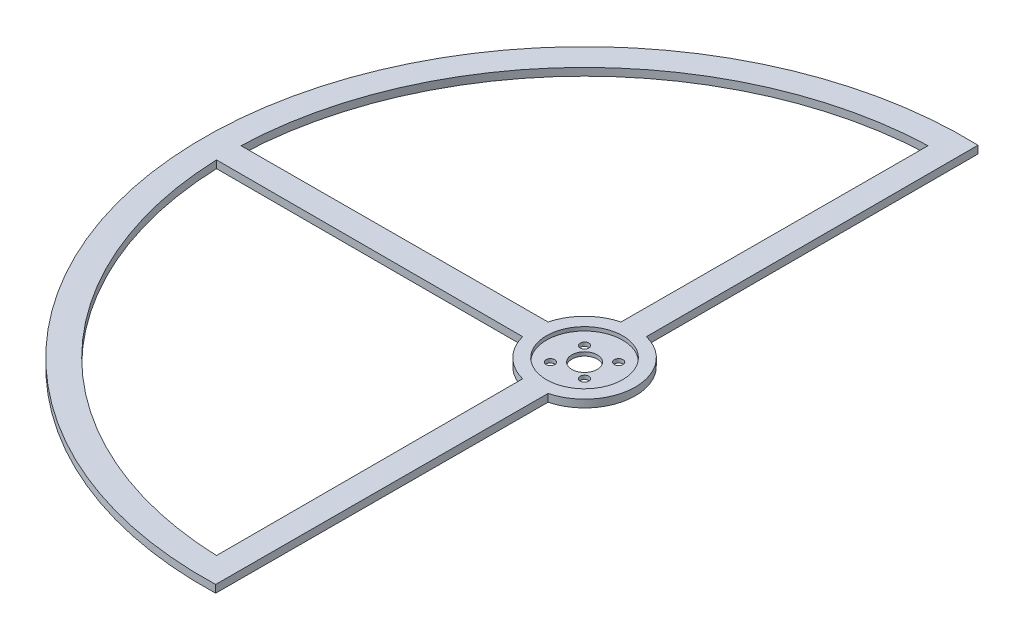
ISO-10303-21;
HEADER;
FILE_DESCRIPTION(('STEP AP214'),'2;1');
FILE_NAME('part.step','',(''),(''),'','','');
FILE_SCHEMA(('AUTOMOTIVE_DESIGN { 1 0 10303 214 1 1 1 1 }'));
ENDSEC;
DATA;
#1=APPLICATION_CONTEXT('core data for automotive mechanical design processes');
#2=APPLICATION_PROTOCOL_DEFINITION('international standard','automotive_design',2000,#1);
#3=PRODUCT_CONTEXT('',#1,'mechanical');
#4=PRODUCT('Part','Part','',(#3));
#5=PRODUCT_RELATED_PRODUCT_CATEGORY('part','',(#4));
#6=PRODUCT_DEFINITION_FORMATION('','',#4);
#7=PRODUCT_DEFINITION_CONTEXT('part definition',#1,'design');
#8=PRODUCT_DEFINITION('design','',#6,#7);
#9=PRODUCT_DEFINITION_SHAPE('','',#8);
#10=(LENGTH_UNIT() NAMED_UNIT(*) SI_UNIT(.MILLI.,.METRE.));
#11=(NAMED_UNIT(*) PLANE_ANGLE_UNIT() SI_UNIT($,.RADIAN.));
#12=(NAMED_UNIT(*) SI_UNIT($,.STERADIAN.) SOLID_ANGLE_UNIT());
#13=UNCERTAINTY_MEASURE_WITH_UNIT(LENGTH_MEASURE(1.E-05),#10,'distance_accuracy_value','');
#14=(GEOMETRIC_REPRESENTATION_CONTEXT(3) GLOBAL_UNCERTAINTY_ASSIGNED_CONTEXT((#13)) GLOBAL_UNIT_ASSIGNED_CONTEXT((#10,
#11,#12)) REPRESENTATION_CONTEXT('',''));
#15=CARTESIAN_POINT('',(0.,0.,0.));
#16=DIRECTION('',(0.,0.,1.));
#17=DIRECTION('',(1.,0.,0.));
#18=AXIS2_PLACEMENT_3D('',#15,#16,#17);
#19=CARTESIAN_POINT('',(0.,3.,0.));
#20=DIRECTION('',(0.,-1.,0.));
#21=DIRECTION('',(0.,0.,-1.));
#22=AXIS2_PLACEMENT_3D('',#19,#20,#21);
#23=CYLINDRICAL_SURFACE('',#22,5.);
#24=CARTESIAN_POINT('',(0.,0.,0.));
#25=DIRECTION('',(0.,1.,0.));
#26=DIRECTION('',(0.,0.,1.));
#27=AXIS2_PLACEMENT_3D('',#24,#25,#26);
#28=CIRCLE('',#27,5.);
#29=CARTESIAN_POINT('',(0.,0.,5.));
#30=VERTEX_POINT('',#29);
#31=EDGE_CURVE('E203',#30,#30,#28,.T.);
#32=ORIENTED_EDGE('',*,*,#31,.F.);
#33=EDGE_LOOP('',(#32));
#34=FACE_BOUND('',#33,.T.);
#35=CARTESIAN_POINT('',(0.,1.5,0.));
#36=DIRECTION('',(0.,1.,0.));
#37=DIRECTION('',(0.,0.,1.));
#38=AXIS2_PLACEMENT_3D('',#35,#36,#37);
#39=CIRCLE('',#38,5.);
#40=CARTESIAN_POINT('',(0.,1.5,5.));
#41=VERTEX_POINT('',#40);
#42=EDGE_CURVE('E151',#41,#41,#39,.T.);
#43=ORIENTED_EDGE('',*,*,#42,.T.);
#44=EDGE_LOOP('',(#43));
#45=FACE_BOUND('',#44,.T.);
#46=ADVANCED_FACE('F32',(#34,#45),#23,.F.);
#47=CARTESIAN_POINT('',(-5.65685424949238,3.,-5.65685424949238));
#48=DIRECTION('',(0.,-1.,0.));
#49=DIRECTION('',(0.,0.,-1.));
#50=AXIS2_PLACEMENT_3D('',#47,#48,#49);
#51=CYLINDRICAL_SURFACE('',#50,1.7);
#52=CARTESIAN_POINT('',(-5.65685424949238,0.,-5.65685424949238));
#53=DIRECTION('',(0.,1.,0.));
#54=DIRECTION('',(0.,0.,1.));
#55=AXIS2_PLACEMENT_3D('',#52,#53,#54);
#56=CIRCLE('',#55,1.7);
#57=CARTESIAN_POINT('',(-5.65685424949238,0.,-3.95685424949238));
#58=VERTEX_POINT('',#57);
#59=EDGE_CURVE('E200',#58,#58,#56,.T.);
#60=ORIENTED_EDGE('',*,*,#59,.F.);
#61=EDGE_LOOP('',(#60));
#62=FACE_BOUND('',#61,.T.);
#63=CARTESIAN_POINT('',(-5.65685424949238,1.5,-5.65685424949238));
#64=DIRECTION('',(0.,1.,0.));
#65=DIRECTION('',(0.,0.,1.));
#66=AXIS2_PLACEMENT_3D('',#63,#64,#65);
#67=CIRCLE('',#66,1.7);
#68=CARTESIAN_POINT('',(-5.65685424949238,1.5,-3.95685424949238));
#69=VERTEX_POINT('',#68);
#70=EDGE_CURVE('E311',#69,#69,#67,.T.);
#71=ORIENTED_EDGE('',*,*,#70,.T.);
#72=EDGE_LOOP('',(#71));
#73=FACE_BOUND('',#72,.T.);
#74=ADVANCED_FACE('F259',(#62,#73),#51,.F.);
#75=CARTESIAN_POINT('',(5.65685424949238,3.,5.65685424949238));
#76=DIRECTION('',(0.,-1.,0.));
#77=DIRECTION('',(0.,0.,-1.));
#78=AXIS2_PLACEMENT_3D('',#75,#76,#77);
#79=CYLINDRICAL_SURFACE('',#78,1.7);
#80=CARTESIAN_POINT('',(5.65685424949238,0.,5.65685424949238));
#81=DIRECTION('',(0.,1.,0.));
#82=DIRECTION('',(0.,0.,1.));
#83=AXIS2_PLACEMENT_3D('',#80,#81,#82);
#84=CIRCLE('',#83,1.7);
#85=CARTESIAN_POINT('',(5.65685424949238,0.,7.35685424949238));
#86=VERTEX_POINT('',#85);
#87=EDGE_CURVE('E197',#86,#86,#84,.T.);
#88=ORIENTED_EDGE('',*,*,#87,.F.);
#89=EDGE_LOOP('',(#88));
#90=FACE_BOUND('',#89,.T.);
#91=CARTESIAN_POINT('',(5.65685424949238,1.5,5.65685424949238));
#92=DIRECTION('',(0.,1.,0.));
#93=DIRECTION('',(0.,0.,1.));
#94=AXIS2_PLACEMENT_3D('',#91,#92,#93);
#95=CIRCLE('',#94,1.7);
#96=CARTESIAN_POINT('',(5.65685424949238,1.5,7.35685424949238));
#97=VERTEX_POINT('',#96);
#98=EDGE_CURVE('E309',#97,#97,#95,.T.);
#99=ORIENTED_EDGE('',*,*,#98,.T.);
#100=EDGE_LOOP('',(#99));
#101=FACE_BOUND('',#100,.T.);
#102=ADVANCED_FACE('F265',(#90,#101),#79,.F.);
#103=CARTESIAN_POINT('',(6.7175144212722,3.,-6.7175144212722));
#104=DIRECTION('',(0.,-1.,0.));
#105=DIRECTION('',(0.,0.,-1.));
#106=AXIS2_PLACEMENT_3D('',#103,#104,#105);
#107=CYLINDRICAL_SURFACE('',#106,1.7);
#108=CARTESIAN_POINT('',(6.7175144212722,0.,-6.7175144212722));
#109=DIRECTION('',(0.,1.,0.));
#110=DIRECTION('',(0.,0.,1.));
#111=AXIS2_PLACEMENT_3D('',#108,#109,#110);
#112=CIRCLE('',#111,1.7);
#113=CARTESIAN_POINT('',(6.7175144212722,0.,-5.0175144212722));
#114=VERTEX_POINT('',#113);
#115=EDGE_CURVE('E194',#114,#114,#112,.T.);
#116=ORIENTED_EDGE('',*,*,#115,.F.);
#117=EDGE_LOOP('',(#116));
#118=FACE_BOUND('',#117,.T.);
#119=CARTESIAN_POINT('',(6.7175144212722,1.5,-6.7175144212722));
#120=DIRECTION('',(0.,1.,0.));
#121=DIRECTION('',(0.,0.,1.));
#122=AXIS2_PLACEMENT_3D('',#119,#120,#121);
#123=CIRCLE('',#122,1.7);
#124=CARTESIAN_POINT('',(6.7175144212722,1.5,-5.0175144212722));
#125=VERTEX_POINT('',#124);
#126=EDGE_CURVE('E312',#125,#125,#123,.T.);
#127=ORIENTED_EDGE('',*,*,#126,.T.);
#128=EDGE_LOOP('',(#127));
#129=FACE_BOUND('',#128,.T.);
#130=ADVANCED_FACE('F297',(#118,#129),#107,.F.);
#131=CARTESIAN_POINT('',(-6.7175144212722,3.,6.7175144212722));
#132=DIRECTION('',(0.,-1.,0.));
#133=DIRECTION('',(0.,0.,-1.));
#134=AXIS2_PLACEMENT_3D('',#131,#132,#133);
#135=CYLINDRICAL_SURFACE('',#134,1.7);
#136=CARTESIAN_POINT('',(-6.7175144212722,0.,6.7175144212722));
#137=DIRECTION('',(0.,1.,0.));
#138=DIRECTION('',(0.,0.,1.));
#139=AXIS2_PLACEMENT_3D('',#136,#137,#138);
#140=CIRCLE('',#139,1.7);
#141=CARTESIAN_POINT('',(-6.7175144212722,0.,8.4175144212722));
#142=VERTEX_POINT('',#141);
#143=EDGE_CURVE('E191',#142,#142,#140,.T.);
#144=ORIENTED_EDGE('',*,*,#143,.F.);
#145=EDGE_LOOP('',(#144));
#146=FACE_BOUND('',#145,.T.);
#147=CARTESIAN_POINT('',(-6.7175144212722,1.5,6.7175144212722));
#148=DIRECTION('',(0.,1.,0.));
#149=DIRECTION('',(0.,0.,1.));
#150=AXIS2_PLACEMENT_3D('',#147,#148,#149);
#151=CIRCLE('',#150,1.7);
#152=CARTESIAN_POINT('',(-6.7175144212722,1.5,8.4175144212722));
#153=VERTEX_POINT('',#152);
#154=EDGE_CURVE('E36',#153,#153,#151,.T.);
#155=ORIENTED_EDGE('',*,*,#154,.T.);
#156=EDGE_LOOP('',(#155));
#157=FACE_BOUND('',#156,.T.);
#158=ADVANCED_FACE('F274',(#146,#157),#135,.F.);
#159=CARTESIAN_POINT('',(0.,3.,0.));
#160=DIRECTION('',(0.,1.,0.));
#161=DIRECTION('',(0.,0.,1.));
#162=AXIS2_PLACEMENT_3D('',#159,#160,#161);
#163=PLANE('',#162);
#164=CARTESIAN_POINT('',(0.,3.,0.));
#165=DIRECTION('',(0.,1.,0.));
#166=DIRECTION('',(0.,0.,1.));
#167=AXIS2_PLACEMENT_3D('',#164,#165,#166);
#168=CIRCLE('',#167,15.);
#169=CARTESIAN_POINT('',(0.,3.,15.));
#170=VERTEX_POINT('',#169);
#171=EDGE_CURVE('E338',#170,#170,#168,.T.);
#172=ORIENTED_EDGE('',*,*,#171,.F.);
#173=EDGE_LOOP('',(#172));
#174=FACE_BOUND('',#173,.T.);
#175=DIRECTION('',(0.,0.,-1.));
#176=VECTOR('',#175,1.);
#177=CARTESIAN_POINT('',(-5.,3.,19.3649167310371));
#178=LINE('',#177,#176);
#179=CARTESIAN_POINT('',(-4.99999999999998,3.,139.910685796332));
#180=VERTEX_POINT('',#179);
#181=CARTESIAN_POINT('',(-5.,3.,19.3649167310371));
#182=VERTEX_POINT('',#181);
#183=EDGE_CURVE('E163',#180,#182,#178,.T.);
#184=ORIENTED_EDGE('',*,*,#183,.F.);
#185=CARTESIAN_POINT('',(0.,3.,0.));
#186=DIRECTION('',(0.,1.,0.));
#187=DIRECTION('',(0.,0.,1.));
#188=AXIS2_PLACEMENT_3D('',#185,#186,#187);
#189=CIRCLE('',#188,140.);
#190=CARTESIAN_POINT('',(-139.910685796332,3.,5.00000000000002));
#191=VERTEX_POINT('',#190);
#192=EDGE_CURVE('E161',#191,#180,#189,.T.);
#193=ORIENTED_EDGE('',*,*,#192,.F.);
#194=DIRECTION('',(-1.,0.,0.));
#195=VECTOR('',#194,1.);
#196=CARTESIAN_POINT('',(-19.3649167310371,3.,5.));
#197=LINE('',#196,#195);
#198=CARTESIAN_POINT('',(-19.3649167310371,3.,5.));
#199=VERTEX_POINT('',#198);
#200=EDGE_CURVE('E169',#199,#191,#197,.T.);
#201=ORIENTED_EDGE('',*,*,#200,.F.);
#202=CARTESIAN_POINT('',(0.,3.,0.));
#203=DIRECTION('',(0.,-1.,0.));
#204=DIRECTION('',(0.,0.,1.));
#205=AXIS2_PLACEMENT_3D('',#202,#203,#204);
#206=CIRCLE('',#205,20.);
#207=EDGE_CURVE('E166',#182,#199,#206,.T.);
#208=ORIENTED_EDGE('',*,*,#207,.F.);
#209=EDGE_LOOP('',(#184,#193,#201,#208));
#210=FACE_BOUND('',#209,.T.);
#211=CARTESIAN_POINT('',(0.,3.,0.));
#212=DIRECTION('',(0.,1.,0.));
#213=DIRECTION('',(0.,0.,1.));
#214=AXIS2_PLACEMENT_3D('',#211,#212,#213);
#215=CIRCLE('',#214,150.);
#216=CARTESIAN_POINT('',(5.,3.,-149.916643505649));
#217=VERTEX_POINT('',#216);
#218=CARTESIAN_POINT('',(4.68749999999998,3.,149.92673992237));
#219=VERTEX_POINT('',#218);
#220=EDGE_CURVE('E207',#217,#219,#215,.T.);
#221=ORIENTED_EDGE('',*,*,#220,.T.);
#222=DIRECTION('',(0.00239349525942759,0.,-0.999997135586119));
#223=VECTOR('',#222,1.);
#224=CARTESIAN_POINT('',(5.,3.,19.3649167310371));
#225=LINE('',#224,#223);
#226=CARTESIAN_POINT('',(5.,3.,19.3649167310371));
#227=VERTEX_POINT('',#226);
#228=EDGE_CURVE('E210',#219,#227,#225,.T.);
#229=ORIENTED_EDGE('',*,*,#228,.T.);
#230=CARTESIAN_POINT('',(0.,3.,0.));
#231=DIRECTION('',(0.,1.,0.));
#232=DIRECTION('',(0.,0.,1.));
#233=AXIS2_PLACEMENT_3D('',#230,#231,#232);
#234=CIRCLE('',#233,20.);
#235=CARTESIAN_POINT('',(5.,3.,-19.3649167310371));
#236=VERTEX_POINT('',#235);
#237=EDGE_CURVE('E213',#227,#236,#234,.T.);
#238=ORIENTED_EDGE('',*,*,#237,.T.);
#239=DIRECTION('',(0.,0.,-1.));
#240=VECTOR('',#239,1.);
#241=CARTESIAN_POINT('',(5.,3.,-19.3649167310371));
#242=LINE('',#241,#240);
#243=EDGE_CURVE('E215',#236,#217,#242,.T.);
#244=ORIENTED_EDGE('',*,*,#243,.T.);
#245=EDGE_LOOP('',(#221,#229,#238,#244));
#246=FACE_BOUND('',#245,.T.);
#247=DIRECTION('',(0.999996177582726,0.,-0.00276492675085444));
#248=VECTOR('',#247,1.);
#249=CARTESIAN_POINT('',(-19.3649167310371,3.,-5.));
#250=LINE('',#249,#248);
#251=CARTESIAN_POINT('',(-139.922200605273,3.,-4.66666666666668));
#252=VERTEX_POINT('',#251);
#253=CARTESIAN_POINT('',(-19.3649167310371,3.,-5.));
#254=VERTEX_POINT('',#253);
#255=EDGE_CURVE('E130',#252,#254,#250,.T.);
#256=ORIENTED_EDGE('',*,*,#255,.F.);
#257=CARTESIAN_POINT('',(0.,3.,0.));
#258=DIRECTION('',(0.,1.,0.));
#259=DIRECTION('',(0.,0.,1.));
#260=AXIS2_PLACEMENT_3D('',#257,#258,#259);
#261=CIRCLE('',#260,140.);
#262=CARTESIAN_POINT('',(-4.66666666666665,3.,-139.922200605273));
#263=VERTEX_POINT('',#262);
#264=EDGE_CURVE('E122',#263,#252,#261,.T.);
#265=ORIENTED_EDGE('',*,*,#264,.F.);
#266=DIRECTION('',(0.00276492675085467,0.,-0.999996177582726));
#267=VECTOR('',#266,1.);
#268=CARTESIAN_POINT('',(-5.,3.,-19.3649167310371));
#269=LINE('',#268,#267);
#270=CARTESIAN_POINT('',(-5.,3.,-19.3649167310371));
#271=VERTEX_POINT('',#270);
#272=EDGE_CURVE('E145',#271,#263,#269,.T.);
#273=ORIENTED_EDGE('',*,*,#272,.F.);
#274=CARTESIAN_POINT('',(0.,3.,0.));
#275=DIRECTION('',(0.,-1.,0.));
#276=DIRECTION('',(0.,0.,1.));
#277=AXIS2_PLACEMENT_3D('',#274,#275,#276);
#278=CIRCLE('',#277,20.);
#279=EDGE_CURVE('E143',#254,#271,#278,.T.);
#280=ORIENTED_EDGE('',*,*,#279,.F.);
#281=EDGE_LOOP('',(#256,#265,#273,#280));
#282=FACE_BOUND('',#281,.T.);
#283=ADVANCED_FACE('F142',(#174,#210,#246,#282),#163,.T.);
#284=CARTESIAN_POINT('',(0.,0.,0.));
#285=DIRECTION('',(0.,1.,0.));
#286=DIRECTION('',(0.,0.,1.));
#287=AXIS2_PLACEMENT_3D('',#284,#285,#286);
#288=PLANE('',#287);
#289=CARTESIAN_POINT('',(0.,0.,0.));
#290=DIRECTION('',(0.,1.,0.));
#291=DIRECTION('',(0.,0.,1.));
#292=AXIS2_PLACEMENT_3D('',#289,#290,#291);
#293=CIRCLE('',#292,140.);
#294=CARTESIAN_POINT('',(-139.910685796332,0.,5.00000000000002));
#295=VERTEX_POINT('',#294);
#296=CARTESIAN_POINT('',(-4.99999999999998,0.,139.910685796332));
#297=VERTEX_POINT('',#296);
#298=EDGE_CURVE('E138',#295,#297,#293,.T.);
#299=ORIENTED_EDGE('',*,*,#298,.T.);
#300=DIRECTION('',(0.,0.,-1.));
#301=VECTOR('',#300,1.);
#302=CARTESIAN_POINT('',(-5.,0.,19.3649167310371));
#303=LINE('',#302,#301);
#304=CARTESIAN_POINT('',(-5.,0.,19.3649167310371));
#305=VERTEX_POINT('',#304);
#306=EDGE_CURVE('E174',#297,#305,#303,.T.);
#307=ORIENTED_EDGE('',*,*,#306,.T.);
#308=CARTESIAN_POINT('',(0.,0.,0.));
#309=DIRECTION('',(0.,-1.,0.));
#310=DIRECTION('',(0.,0.,1.));
#311=AXIS2_PLACEMENT_3D('',#308,#309,#310);
#312=CIRCLE('',#311,20.);
#313=CARTESIAN_POINT('',(-19.3649167310371,0.,5.));
#314=VERTEX_POINT('',#313);
#315=EDGE_CURVE('E177',#305,#314,#312,.T.);
#316=ORIENTED_EDGE('',*,*,#315,.T.);
#317=DIRECTION('',(-1.,0.,0.));
#318=VECTOR('',#317,1.);
#319=CARTESIAN_POINT('',(-19.3649167310371,0.,5.));
#320=LINE('',#319,#318);
#321=EDGE_CURVE('E164',#314,#295,#320,.T.);
#322=ORIENTED_EDGE('',*,*,#321,.T.);
#323=EDGE_LOOP('',(#299,#307,#316,#322));
#324=FACE_BOUND('',#323,.T.);
#325=ORIENTED_EDGE('',*,*,#115,.T.);
#326=EDGE_LOOP('',(#325));
#327=FACE_BOUND('',#326,.T.);
#328=ORIENTED_EDGE('',*,*,#59,.T.);
#329=EDGE_LOOP('',(#328));
#330=FACE_BOUND('',#329,.T.);
#331=CARTESIAN_POINT('',(0.,0.,0.));
#332=DIRECTION('',(0.,1.,0.));
#333=DIRECTION('',(0.,0.,1.));
#334=AXIS2_PLACEMENT_3D('',#331,#332,#333);
#335=CIRCLE('',#334,150.);
#336=CARTESIAN_POINT('',(5.,0.,-149.916643505649));
#337=VERTEX_POINT('',#336);
#338=CARTESIAN_POINT('',(4.68749999999998,0.,149.92673992237));
#339=VERTEX_POINT('',#338);
#340=EDGE_CURVE('E206',#337,#339,#335,.T.);
#341=ORIENTED_EDGE('',*,*,#340,.F.);
#342=DIRECTION('',(0.,0.,-1.));
#343=VECTOR('',#342,1.);
#344=CARTESIAN_POINT('',(5.,0.,-19.3649167310371));
#345=LINE('',#344,#343);
#346=CARTESIAN_POINT('',(5.,0.,-19.3649167310371));
#347=VERTEX_POINT('',#346);
#348=EDGE_CURVE('E211',#347,#337,#345,.T.);
#349=ORIENTED_EDGE('',*,*,#348,.F.);
#350=CARTESIAN_POINT('',(0.,0.,0.));
#351=DIRECTION('',(0.,1.,0.));
#352=DIRECTION('',(0.,0.,1.));
#353=AXIS2_PLACEMENT_3D('',#350,#351,#352);
#354=CIRCLE('',#353,20.);
#355=CARTESIAN_POINT('',(5.,0.,19.3649167310371));
#356=VERTEX_POINT('',#355);
#357=EDGE_CURVE('E222',#356,#347,#354,.T.);
#358=ORIENTED_EDGE('',*,*,#357,.F.);
#359=DIRECTION('',(0.00239349525942759,0.,-0.999997135586119));
#360=VECTOR('',#359,1.);
#361=CARTESIAN_POINT('',(5.,0.,19.3649167310371));
#362=LINE('',#361,#360);
#363=EDGE_CURVE('E220',#339,#356,#362,.T.);
#364=ORIENTED_EDGE('',*,*,#363,.F.);
#365=EDGE_LOOP('',(#341,#349,#358,#364));
#366=FACE_BOUND('',#365,.T.);
#367=ORIENTED_EDGE('',*,*,#31,.T.);
#368=EDGE_LOOP('',(#367));
#369=FACE_BOUND('',#368,.T.);
#370=ORIENTED_EDGE('',*,*,#87,.T.);
#371=EDGE_LOOP('',(#370));
#372=FACE_BOUND('',#371,.T.);
#373=ORIENTED_EDGE('',*,*,#143,.T.);
#374=EDGE_LOOP('',(#373));
#375=FACE_BOUND('',#374,.T.);
#376=CARTESIAN_POINT('',(0.,0.,0.));
#377=DIRECTION('',(0.,1.,0.));
#378=DIRECTION('',(0.,0.,1.));
#379=AXIS2_PLACEMENT_3D('',#376,#377,#378);
#380=CIRCLE('',#379,140.);
#381=CARTESIAN_POINT('',(-4.66666666666665,0.,-139.922200605273));
#382=VERTEX_POINT('',#381);
#383=CARTESIAN_POINT('',(-139.922200605273,0.,-4.66666666666668));
#384=VERTEX_POINT('',#383);
#385=EDGE_CURVE('E56',#382,#384,#380,.T.);
#386=ORIENTED_EDGE('',*,*,#385,.T.);
#387=DIRECTION('',(0.999996177582726,0.,-0.00276492675085444));
#388=VECTOR('',#387,1.);
#389=CARTESIAN_POINT('',(-19.3649167310371,0.,-5.));
#390=LINE('',#389,#388);
#391=CARTESIAN_POINT('',(-19.3649167310371,0.,-5.));
#392=VERTEX_POINT('',#391);
#393=EDGE_CURVE('E137',#384,#392,#390,.T.);
#394=ORIENTED_EDGE('',*,*,#393,.T.);
#395=CARTESIAN_POINT('',(0.,0.,0.));
#396=DIRECTION('',(0.,-1.,0.));
#397=DIRECTION('',(0.,0.,1.));
#398=AXIS2_PLACEMENT_3D('',#395,#396,#397);
#399=CIRCLE('',#398,20.);
#400=CARTESIAN_POINT('',(-4.99999999999999,0.,-19.3649167310371));
#401=VERTEX_POINT('',#400);
#402=EDGE_CURVE('E153',#392,#401,#399,.T.);
#403=ORIENTED_EDGE('',*,*,#402,.T.);
#404=DIRECTION('',(0.00276492675085467,0.,-0.999996177582726));
#405=VECTOR('',#404,1.);
#406=CARTESIAN_POINT('',(-5.,0.,-19.3649167310371));
#407=LINE('',#406,#405);
#408=EDGE_CURVE('E131',#401,#382,#407,.T.);
#409=ORIENTED_EDGE('',*,*,#408,.T.);
#410=EDGE_LOOP('',(#386,#394,#403,#409));
#411=FACE_BOUND('',#410,.T.);
#412=ADVANCED_FACE('F241',(#324,#327,#330,#366,#369,#372,#375,#411),#288,.F.);
#413=CARTESIAN_POINT('',(0.,3.,0.));
#414=DIRECTION('',(0.,-1.,0.));
#415=DIRECTION('',(0.,0.,-1.));
#416=AXIS2_PLACEMENT_3D('',#413,#414,#415);
#417=CYLINDRICAL_SURFACE('',#416,150.);
#418=ORIENTED_EDGE('',*,*,#340,.T.);
#419=DIRECTION('',(0.,-1.,0.));
#420=VECTOR('',#419,1.);
#421=CARTESIAN_POINT('',(4.68749999999998,3.,149.92673992237));
#422=LINE('',#421,#420);
#423=EDGE_CURVE('E11',#219,#339,#422,.T.);
#424=ORIENTED_EDGE('',*,*,#423,.F.);
#425=ORIENTED_EDGE('',*,*,#220,.F.);
#426=DIRECTION('',(0.,-1.,0.));
#427=VECTOR('',#426,1.);
#428=CARTESIAN_POINT('',(5.,3.,-149.916643505649));
#429=LINE('',#428,#427);
#430=EDGE_CURVE('E217',#217,#337,#429,.T.);
#431=ORIENTED_EDGE('',*,*,#430,.T.);
#432=EDGE_LOOP('',(#418,#424,#425,#431));
#433=FACE_BOUND('',#432,.T.);
#434=ADVANCED_FACE('F34',(#433),#417,.T.);
#435=CARTESIAN_POINT('',(5.,3.,19.3649167310371));
#436=DIRECTION('',(-0.999997135586119,0.,-0.00239349525942759));
#437=DIRECTION('',(-0.00239349525942759,0.,0.999997135586119));
#438=AXIS2_PLACEMENT_3D('',#435,#436,#437);
#439=PLANE('',#438);
#440=ORIENTED_EDGE('',*,*,#363,.T.);
#441=DIRECTION('',(0.,-1.,0.));
#442=VECTOR('',#441,1.);
#443=CARTESIAN_POINT('',(5.,3.,19.3649167310371));
#444=LINE('',#443,#442);
#445=EDGE_CURVE('E41',#227,#356,#444,.T.);
#446=ORIENTED_EDGE('',*,*,#445,.F.);
#447=ORIENTED_EDGE('',*,*,#228,.F.);
#448=ORIENTED_EDGE('',*,*,#423,.T.);
#449=EDGE_LOOP('',(#440,#446,#447,#448));
#450=FACE_BOUND('',#449,.T.);
#451=ADVANCED_FACE('F251',(#450),#439,.F.);
#452=CARTESIAN_POINT('',(0.,3.,0.));
#453=DIRECTION('',(0.,-1.,0.));
#454=DIRECTION('',(0.,0.,-1.));
#455=AXIS2_PLACEMENT_3D('',#452,#453,#454);
#456=CYLINDRICAL_SURFACE('',#455,20.);
#457=ORIENTED_EDGE('',*,*,#357,.T.);
#458=DIRECTION('',(0.,-1.,0.));
#459=VECTOR('',#458,1.);
#460=CARTESIAN_POINT('',(5.,3.,-19.3649167310371));
#461=LINE('',#460,#459);
#462=EDGE_CURVE('E227',#236,#347,#461,.T.);
#463=ORIENTED_EDGE('',*,*,#462,.F.);
#464=ORIENTED_EDGE('',*,*,#237,.F.);
#465=ORIENTED_EDGE('',*,*,#445,.T.);
#466=EDGE_LOOP('',(#457,#463,#464,#465));
#467=FACE_BOUND('',#466,.T.);
#468=ADVANCED_FACE('F235',(#467),#456,.T.);
#469=CARTESIAN_POINT('',(5.,3.,-19.3649167310371));
#470=DIRECTION('',(-1.,0.,0.));
#471=DIRECTION('',(0.,0.,1.));
#472=AXIS2_PLACEMENT_3D('',#469,#470,#471);
#473=PLANE('',#472);
#474=ORIENTED_EDGE('',*,*,#348,.T.);
#475=ORIENTED_EDGE('',*,*,#430,.F.);
#476=ORIENTED_EDGE('',*,*,#243,.F.);
#477=ORIENTED_EDGE('',*,*,#462,.T.);
#478=EDGE_LOOP('',(#474,#475,#476,#477));
#479=FACE_BOUND('',#478,.T.);
#480=ADVANCED_FACE('F245',(#479),#473,.F.);
#481=CARTESIAN_POINT('',(0.,3.,0.));
#482=DIRECTION('',(0.,-1.,0.));
#483=DIRECTION('',(0.,0.,-1.));
#484=AXIS2_PLACEMENT_3D('',#481,#482,#483);
#485=CYLINDRICAL_SURFACE('',#484,140.);
#486=ORIENTED_EDGE('',*,*,#298,.F.);
#487=DIRECTION('',(0.,-1.,0.));
#488=VECTOR('',#487,1.);
#489=CARTESIAN_POINT('',(-139.910685796332,3.,5.00000000000002));
#490=LINE('',#489,#488);
#491=EDGE_CURVE('E171',#191,#295,#490,.T.);
#492=ORIENTED_EDGE('',*,*,#491,.F.);
#493=ORIENTED_EDGE('',*,*,#192,.T.);
#494=DIRECTION('',(0.,-1.,0.));
#495=VECTOR('',#494,1.);
#496=CARTESIAN_POINT('',(-4.99999999999998,3.,139.910685796332));
#497=LINE('',#496,#495);
#498=EDGE_CURVE('E188',#180,#297,#497,.T.);
#499=ORIENTED_EDGE('',*,*,#498,.T.);
#500=EDGE_LOOP('',(#486,#492,#493,#499));
#501=FACE_BOUND('',#500,.T.);
#502=ADVANCED_FACE('F280',(#501),#485,.F.);
#503=CARTESIAN_POINT('',(-5.,3.,19.3649167310371));
#504=DIRECTION('',(-1.,0.,0.));
#505=DIRECTION('',(0.,0.,1.));
#506=AXIS2_PLACEMENT_3D('',#503,#504,#505);
#507=PLANE('',#506);
#508=ORIENTED_EDGE('',*,*,#306,.F.);
#509=ORIENTED_EDGE('',*,*,#498,.F.);
#510=ORIENTED_EDGE('',*,*,#183,.T.);
#511=DIRECTION('',(0.,-1.,0.));
#512=VECTOR('',#511,1.);
#513=CARTESIAN_POINT('',(-5.,3.,19.3649167310371));
#514=LINE('',#513,#512);
#515=EDGE_CURVE('E186',#182,#305,#514,.T.);
#516=ORIENTED_EDGE('',*,*,#515,.T.);
#517=EDGE_LOOP('',(#508,#509,#510,#516));
#518=FACE_BOUND('',#517,.T.);
#519=ADVANCED_FACE('F284',(#518),#507,.T.);
#520=CARTESIAN_POINT('',(0.,3.,0.));
#521=DIRECTION('',(0.,-1.,0.));
#522=DIRECTION('',(0.,0.,-1.));
#523=AXIS2_PLACEMENT_3D('',#520,#521,#522);
#524=CYLINDRICAL_SURFACE('',#523,20.);
#525=ORIENTED_EDGE('',*,*,#315,.F.);
#526=ORIENTED_EDGE('',*,*,#515,.F.);
#527=ORIENTED_EDGE('',*,*,#207,.T.);
#528=DIRECTION('',(0.,-1.,0.));
#529=VECTOR('',#528,1.);
#530=CARTESIAN_POINT('',(-19.3649167310371,3.,5.));
#531=LINE('',#530,#529);
#532=EDGE_CURVE('E184',#199,#314,#531,.T.);
#533=ORIENTED_EDGE('',*,*,#532,.T.);
#534=EDGE_LOOP('',(#525,#526,#527,#533));
#535=FACE_BOUND('',#534,.T.);
#536=ADVANCED_FACE('F290',(#535),#524,.T.);
#537=CARTESIAN_POINT('',(-19.3649167310371,3.,5.));
#538=DIRECTION('',(0.,0.,1.));
#539=DIRECTION('',(1.,0.,0.));
#540=AXIS2_PLACEMENT_3D('',#537,#538,#539);
#541=PLANE('',#540);
#542=ORIENTED_EDGE('',*,*,#321,.F.);
#543=ORIENTED_EDGE('',*,*,#532,.F.);
#544=ORIENTED_EDGE('',*,*,#200,.T.);
#545=ORIENTED_EDGE('',*,*,#491,.T.);
#546=EDGE_LOOP('',(#542,#543,#544,#545));
#547=FACE_BOUND('',#546,.T.);
#548=ADVANCED_FACE('F356',(#547),#541,.T.);
#549=CARTESIAN_POINT('',(0.,3.,0.));
#550=DIRECTION('',(0.,-1.,0.));
#551=DIRECTION('',(0.,0.,-1.));
#552=AXIS2_PLACEMENT_3D('',#549,#550,#551);
#553=CYLINDRICAL_SURFACE('',#552,140.);
#554=ORIENTED_EDGE('',*,*,#385,.F.);
#555=DIRECTION('',(0.,-1.,0.));
#556=VECTOR('',#555,1.);
#557=CARTESIAN_POINT('',(-4.66666666666665,3.,-139.922200605273));
#558=LINE('',#557,#556);
#559=EDGE_CURVE('E126',#263,#382,#558,.T.);
#560=ORIENTED_EDGE('',*,*,#559,.F.);
#561=ORIENTED_EDGE('',*,*,#264,.T.);
#562=DIRECTION('',(0.,-1.,0.));
#563=VECTOR('',#562,1.);
#564=CARTESIAN_POINT('',(-139.922200605273,3.,-4.66666666666668));
#565=LINE('',#564,#563);
#566=EDGE_CURVE('E125',#252,#384,#565,.T.);
#567=ORIENTED_EDGE('',*,*,#566,.T.);
#568=EDGE_LOOP('',(#554,#560,#561,#567));
#569=FACE_BOUND('',#568,.T.);
#570=ADVANCED_FACE('F124',(#569),#553,.F.);
#571=CARTESIAN_POINT('',(-19.3649167310371,3.,-5.));
#572=DIRECTION('',(-0.00276492675085444,0.,-0.999996177582726));
#573=DIRECTION('',(-0.999996177582726,0.,0.00276492675085444));
#574=AXIS2_PLACEMENT_3D('',#571,#572,#573);
#575=PLANE('',#574);
#576=ORIENTED_EDGE('',*,*,#393,.F.);
#577=ORIENTED_EDGE('',*,*,#566,.F.);
#578=ORIENTED_EDGE('',*,*,#255,.T.);
#579=DIRECTION('',(0.,-1.,0.));
#580=VECTOR('',#579,1.);
#581=CARTESIAN_POINT('',(-19.3649167310371,3.,-5.));
#582=LINE('',#581,#580);
#583=EDGE_CURVE('E139',#254,#392,#582,.T.);
#584=ORIENTED_EDGE('',*,*,#583,.T.);
#585=EDGE_LOOP('',(#576,#577,#578,#584));
#586=FACE_BOUND('',#585,.T.);
#587=ADVANCED_FACE('F134',(#586),#575,.T.);
#588=CARTESIAN_POINT('',(0.,3.,0.));
#589=DIRECTION('',(0.,-1.,0.));
#590=DIRECTION('',(0.,0.,-1.));
#591=AXIS2_PLACEMENT_3D('',#588,#589,#590);
#592=CYLINDRICAL_SURFACE('',#591,20.);
#593=ORIENTED_EDGE('',*,*,#402,.F.);
#594=ORIENTED_EDGE('',*,*,#583,.F.);
#595=ORIENTED_EDGE('',*,*,#279,.T.);
#596=DIRECTION('',(0.,-1.,0.));
#597=VECTOR('',#596,1.);
#598=CARTESIAN_POINT('',(-4.99999999999999,3.,-19.3649167310371));
#599=LINE('',#598,#597);
#600=EDGE_CURVE('E48',#271,#401,#599,.T.);
#601=ORIENTED_EDGE('',*,*,#600,.T.);
#602=EDGE_LOOP('',(#593,#594,#595,#601));
#603=FACE_BOUND('',#602,.T.);
#604=ADVANCED_FACE('F367',(#603),#592,.T.);
#605=CARTESIAN_POINT('',(-5.,3.,-19.3649167310371));
#606=DIRECTION('',(-0.999996177582726,0.,-0.00276492675085468));
#607=DIRECTION('',(-0.00276492675085468,0.,0.999996177582726));
#608=AXIS2_PLACEMENT_3D('',#605,#606,#607);
#609=PLANE('',#608);
#610=ORIENTED_EDGE('',*,*,#408,.F.);
#611=ORIENTED_EDGE('',*,*,#600,.F.);
#612=ORIENTED_EDGE('',*,*,#272,.T.);
#613=ORIENTED_EDGE('',*,*,#559,.T.);
#614=EDGE_LOOP('',(#610,#611,#612,#613));
#615=FACE_BOUND('',#614,.T.);
#616=ADVANCED_FACE('F370',(#615),#609,.T.);
#617=CARTESIAN_POINT('',(0.,1.5,0.));
#618=DIRECTION('',(0.,1.,0.));
#619=DIRECTION('',(0.,0.,1.));
#620=AXIS2_PLACEMENT_3D('',#617,#618,#619);
#621=CYLINDRICAL_SURFACE('',#620,15.);
#622=CARTESIAN_POINT('',(0.,1.5,0.));
#623=DIRECTION('',(0.,1.,0.));
#624=DIRECTION('',(0.,0.,1.));
#625=AXIS2_PLACEMENT_3D('',#622,#623,#624);
#626=CIRCLE('',#625,15.);
#627=CARTESIAN_POINT('',(0.,1.5,15.));
#628=VERTEX_POINT('',#627);
#629=EDGE_CURVE('E336',#628,#628,#626,.T.);
#630=ORIENTED_EDGE('',*,*,#629,.F.);
#631=EDGE_LOOP('',(#630));
#632=FACE_BOUND('',#631,.T.);
#633=ORIENTED_EDGE('',*,*,#171,.T.);
#634=EDGE_LOOP('',(#633));
#635=FACE_BOUND('',#634,.T.);
#636=ADVANCED_FACE('F325',(#632,#635),#621,.F.);
#637=CARTESIAN_POINT('',(0.,1.5,0.));
#638=DIRECTION('',(0.,1.,0.));
#639=DIRECTION('',(0.,0.,1.));
#640=AXIS2_PLACEMENT_3D('',#637,#638,#639);
#641=PLANE('',#640);
#642=ORIENTED_EDGE('',*,*,#42,.F.);
#643=EDGE_LOOP('',(#642));
#644=FACE_BOUND('',#643,.T.);
#645=ORIENTED_EDGE('',*,*,#70,.F.);
#646=EDGE_LOOP('',(#645));
#647=FACE_BOUND('',#646,.T.);
#648=ORIENTED_EDGE('',*,*,#98,.F.);
#649=EDGE_LOOP('',(#648));
#650=FACE_BOUND('',#649,.T.);
#651=ORIENTED_EDGE('',*,*,#126,.F.);
#652=EDGE_LOOP('',(#651));
#653=FACE_BOUND('',#652,.T.);
#654=ORIENTED_EDGE('',*,*,#154,.F.);
#655=EDGE_LOOP('',(#654));
#656=FACE_BOUND('',#655,.T.);
#657=ORIENTED_EDGE('',*,*,#629,.T.);
#658=EDGE_LOOP('',(#657));
#659=FACE_BOUND('',#658,.T.);
#660=ADVANCED_FACE('F322',(#644,#647,#650,#653,#656,#659),#641,.T.);
#661=CLOSED_SHELL('',(#46,#74,#102,#130,#158,#283,#412,#434,#451,#468,#480,#502,#519,#536,#548,
#570,#587,#604,#616,#636,#660));
#662=MANIFOLD_SOLID_BREP('B2',#661);
#663=ADVANCED_BREP_SHAPE_REPRESENTATION('',(#18,#662),#14);
#664=SHAPE_DEFINITION_REPRESENTATION(#9,#663);
ENDSEC;
END-ISO-10303-21;
